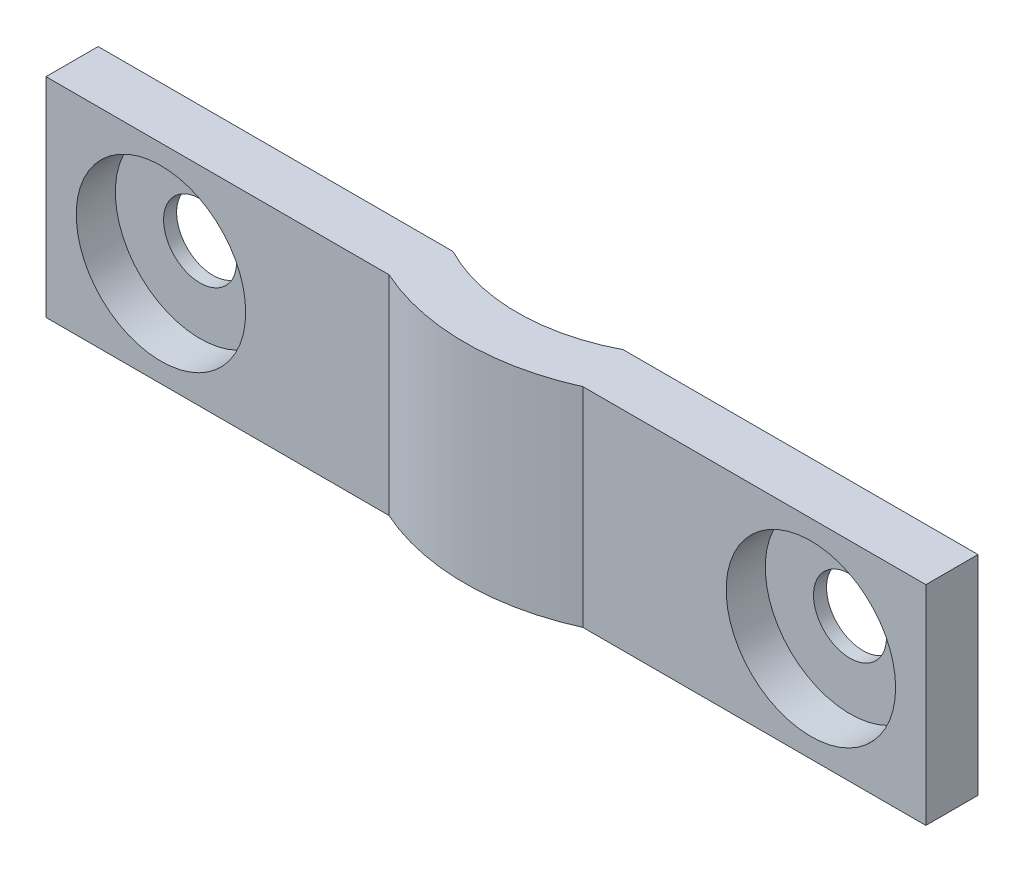
ISO-10303-21;
HEADER;
FILE_DESCRIPTION(('STEP AP214'),'2;1');
FILE_NAME('part.step','',(''),(''),'','','');
FILE_SCHEMA(('AUTOMOTIVE_DESIGN { 1 0 10303 214 1 1 1 1 }'));
ENDSEC;
DATA;
#1=APPLICATION_CONTEXT('core data for automotive mechanical design processes');
#2=APPLICATION_PROTOCOL_DEFINITION('international standard','automotive_design',2000,#1);
#3=PRODUCT_CONTEXT('',#1,'mechanical');
#4=PRODUCT('Part','Part','',(#3));
#5=PRODUCT_RELATED_PRODUCT_CATEGORY('part','',(#4));
#6=PRODUCT_DEFINITION_FORMATION('','',#4);
#7=PRODUCT_DEFINITION_CONTEXT('part definition',#1,'design');
#8=PRODUCT_DEFINITION('design','',#6,#7);
#9=PRODUCT_DEFINITION_SHAPE('','',#8);
#10=(LENGTH_UNIT() NAMED_UNIT(*) SI_UNIT(.MILLI.,.METRE.));
#11=(NAMED_UNIT(*) PLANE_ANGLE_UNIT() SI_UNIT($,.RADIAN.));
#12=(NAMED_UNIT(*) SI_UNIT($,.STERADIAN.) SOLID_ANGLE_UNIT());
#13=UNCERTAINTY_MEASURE_WITH_UNIT(LENGTH_MEASURE(1.E-05),#10,'distance_accuracy_value','');
#14=(GEOMETRIC_REPRESENTATION_CONTEXT(3) GLOBAL_UNCERTAINTY_ASSIGNED_CONTEXT((#13)) GLOBAL_UNIT_ASSIGNED_CONTEXT((#10,
#11,#12)) REPRESENTATION_CONTEXT('',''));
#15=CARTESIAN_POINT('',(0.,0.,0.));
#16=DIRECTION('',(0.,0.,1.));
#17=DIRECTION('',(1.,0.,0.));
#18=AXIS2_PLACEMENT_3D('',#15,#16,#17);
#19=CARTESIAN_POINT('',(-52.019276555044,49.9944163464973,-6.24999999999998));
#20=DIRECTION('',(0.,-1.,0.));
#21=DIRECTION('',(0.,0.,-1.));
#22=AXIS2_PLACEMENT_3D('',#19,#20,#21);
#23=CYLINDRICAL_SURFACE('',#22,9.05);
#24=CARTESIAN_POINT('',(-52.019276555044,41.9944163464973,-6.24999999999998));
#25=DIRECTION('',(0.,1.,0.));
#26=DIRECTION('',(0.,0.,1.));
#27=AXIS2_PLACEMENT_3D('',#24,#25,#26);
#28=CIRCLE('',#27,9.05);
#29=CARTESIAN_POINT('',(-55.7394916025917,41.9944163464973,2.));
#30=VERTEX_POINT('',#29);
#31=CARTESIAN_POINT('',(-48.2990615074963,41.9944163464973,2.));
#32=VERTEX_POINT('',#31);
#33=EDGE_CURVE('E54',#30,#32,#28,.T.);
#34=ORIENTED_EDGE('',*,*,#33,.T.);
#35=DIRECTION('',(0.,-1.,0.));
#36=VECTOR('',#35,1.);
#37=CARTESIAN_POINT('',(-48.2990615074963,49.9944163464973,2.));
#38=LINE('',#37,#36);
#39=CARTESIAN_POINT('',(-48.2990615074963,49.9944163464973,2.));
#40=VERTEX_POINT('',#39);
#41=EDGE_CURVE('E49',#40,#32,#38,.T.);
#42=ORIENTED_EDGE('',*,*,#41,.F.);
#43=CARTESIAN_POINT('',(-52.019276555044,49.9944163464973,-6.24999999999998));
#44=DIRECTION('',(0.,1.,0.));
#45=DIRECTION('',(0.,0.,1.));
#46=AXIS2_PLACEMENT_3D('',#43,#44,#45);
#47=CIRCLE('',#46,9.05);
#48=CARTESIAN_POINT('',(-55.7394916025917,49.9944163464973,2.));
#49=VERTEX_POINT('',#48);
#50=EDGE_CURVE('E153',#49,#40,#47,.T.);
#51=ORIENTED_EDGE('',*,*,#50,.F.);
#52=DIRECTION('',(0.,-1.,0.));
#53=VECTOR('',#52,1.);
#54=CARTESIAN_POINT('',(-55.7394916025917,49.9944163464973,2.));
#55=LINE('',#54,#53);
#56=EDGE_CURVE('E136',#49,#30,#55,.T.);
#57=ORIENTED_EDGE('',*,*,#56,.T.);
#58=EDGE_LOOP('',(#34,#42,#51,#57));
#59=FACE_BOUND('',#58,.T.);
#60=ADVANCED_FACE('F35',(#59),#23,.T.);
#61=CARTESIAN_POINT('',(0.,49.9944163464973,0.));
#62=DIRECTION('',(0.,0.,1.));
#63=DIRECTION('',(1.,0.,0.));
#64=AXIS2_PLACEMENT_3D('',#61,#62,#63);
#65=PLANE('',#64);
#66=CARTESIAN_POINT('',(-64.484276555044,45.9944163464973,0.));
#67=DIRECTION('',(0.,0.,1.));
#68=DIRECTION('',(1.,0.,0.));
#69=AXIS2_PLACEMENT_3D('',#66,#67,#68);
#70=CIRCLE('',#69,1.4);
#71=CARTESIAN_POINT('',(-63.084276555044,45.9944163464973,0.));
#72=VERTEX_POINT('',#71);
#73=EDGE_CURVE('E316',#72,#72,#70,.T.);
#74=ORIENTED_EDGE('',*,*,#73,.T.);
#75=EDGE_LOOP('',(#74));
#76=FACE_BOUND('',#75,.T.);
#77=DIRECTION('',(-1.,0.,0.));
#78=VECTOR('',#77,1.);
#79=CARTESIAN_POINT('',(0.,41.9944163464973,0.));
#80=LINE('',#79,#78);
#81=CARTESIAN_POINT('',(-55.2811778411041,41.9944163464973,0.));
#82=VERTEX_POINT('',#81);
#83=CARTESIAN_POINT('',(-68.894276555044,41.9944163464973,0.));
#84=VERTEX_POINT('',#83);
#85=EDGE_CURVE('E110',#82,#84,#80,.T.);
#86=ORIENTED_EDGE('',*,*,#85,.T.);
#87=DIRECTION('',(0.,1.,0.));
#88=VECTOR('',#87,1.);
#89=CARTESIAN_POINT('',(-68.894276555044,49.9944163464973,0.));
#90=LINE('',#89,#88);
#91=CARTESIAN_POINT('',(-68.894276555044,49.9944163464973,0.));
#92=VERTEX_POINT('',#91);
#93=EDGE_CURVE('E145',#84,#92,#90,.T.);
#94=ORIENTED_EDGE('',*,*,#93,.T.);
#95=DIRECTION('',(-1.,0.,0.));
#96=VECTOR('',#95,1.);
#97=CARTESIAN_POINT('',(0.,49.9944163464973,0.));
#98=LINE('',#97,#96);
#99=CARTESIAN_POINT('',(-55.2811778411041,49.9944163464973,0.));
#100=VERTEX_POINT('',#99);
#101=EDGE_CURVE('E151',#100,#92,#98,.T.);
#102=ORIENTED_EDGE('',*,*,#101,.F.);
#103=DIRECTION('',(0.,-1.,0.));
#104=VECTOR('',#103,1.);
#105=CARTESIAN_POINT('',(-55.2811778411041,49.9944163464973,0.));
#106=LINE('',#105,#104);
#107=EDGE_CURVE('E42',#100,#82,#106,.T.);
#108=ORIENTED_EDGE('',*,*,#107,.T.);
#109=EDGE_LOOP('',(#86,#94,#102,#108));
#110=FACE_BOUND('',#109,.T.);
#111=ADVANCED_FACE('F161',(#76,#110),#65,.F.);
#112=CARTESIAN_POINT('',(-39.554276555044,45.9944163464973,0.));
#113=DIRECTION('',(0.,0.,1.));
#114=DIRECTION('',(1.,0.,0.));
#115=AXIS2_PLACEMENT_3D('',#112,#113,#114);
#116=CIRCLE('',#115,1.4);
#117=CARTESIAN_POINT('',(-38.154276555044,45.9944163464973,0.));
#118=VERTEX_POINT('',#117);
#119=EDGE_CURVE('E322',#118,#118,#116,.F.);
#120=ORIENTED_EDGE('',*,*,#119,.F.);
#121=EDGE_LOOP('',(#120));
#122=FACE_BOUND('',#121,.T.);
#123=CARTESIAN_POINT('',(-35.144276555044,41.9944163464973,0.));
#124=VERTEX_POINT('',#123);
#125=CARTESIAN_POINT('',(-48.757375268984,41.9944163464973,0.));
#126=VERTEX_POINT('',#125);
#127=EDGE_CURVE('E98',#124,#126,#80,.T.);
#128=ORIENTED_EDGE('',*,*,#127,.T.);
#129=DIRECTION('',(0.,-1.,0.));
#130=VECTOR('',#129,1.);
#131=CARTESIAN_POINT('',(-48.757375268984,49.9944163464973,0.));
#132=LINE('',#131,#130);
#133=CARTESIAN_POINT('',(-48.757375268984,49.9944163464973,0.));
#134=VERTEX_POINT('',#133);
#135=EDGE_CURVE('E11',#134,#126,#132,.T.);
#136=ORIENTED_EDGE('',*,*,#135,.F.);
#137=CARTESIAN_POINT('',(-35.144276555044,49.9944163464973,0.));
#138=VERTEX_POINT('',#137);
#139=EDGE_CURVE('E114',#138,#134,#98,.T.);
#140=ORIENTED_EDGE('',*,*,#139,.F.);
#141=DIRECTION('',(0.,1.,0.));
#142=VECTOR('',#141,1.);
#143=CARTESIAN_POINT('',(-35.144276555044,49.9944163464973,0.));
#144=LINE('',#143,#142);
#145=EDGE_CURVE('E112',#124,#138,#144,.T.);
#146=ORIENTED_EDGE('',*,*,#145,.F.);
#147=EDGE_LOOP('',(#128,#136,#140,#146));
#148=FACE_BOUND('',#147,.T.);
#149=ADVANCED_FACE('F113',(#122,#148),#65,.F.);
#150=CARTESIAN_POINT('',(-52.019276555044,49.9944163464973,-6.24999999999998));
#151=DIRECTION('',(0.,-1.,0.));
#152=DIRECTION('',(0.,0.,-1.));
#153=AXIS2_PLACEMENT_3D('',#150,#151,#152);
#154=CYLINDRICAL_SURFACE('',#153,7.05);
#155=CARTESIAN_POINT('',(-52.019276555044,41.9944163464973,-6.24999999999998));
#156=DIRECTION('',(0.,1.,0.));
#157=DIRECTION('',(0.,0.,1.));
#158=AXIS2_PLACEMENT_3D('',#155,#156,#157);
#159=CIRCLE('',#158,7.05);
#160=EDGE_CURVE('E106',#82,#126,#159,.T.);
#161=ORIENTED_EDGE('',*,*,#160,.F.);
#162=ORIENTED_EDGE('',*,*,#107,.F.);
#163=CARTESIAN_POINT('',(-52.019276555044,49.9944163464973,-6.24999999999998));
#164=DIRECTION('',(0.,1.,0.));
#165=DIRECTION('',(0.,0.,1.));
#166=AXIS2_PLACEMENT_3D('',#163,#164,#165);
#167=CIRCLE('',#166,7.05);
#168=EDGE_CURVE('E155',#100,#134,#167,.T.);
#169=ORIENTED_EDGE('',*,*,#168,.T.);
#170=ORIENTED_EDGE('',*,*,#135,.T.);
#171=EDGE_LOOP('',(#161,#162,#169,#170));
#172=FACE_BOUND('',#171,.T.);
#173=ADVANCED_FACE('F166',(#172),#154,.F.);
#174=CARTESIAN_POINT('',(0.,49.9944163464973,0.));
#175=DIRECTION('',(0.,1.,0.));
#176=DIRECTION('',(0.,0.,1.));
#177=AXIS2_PLACEMENT_3D('',#174,#175,#176);
#178=PLANE('',#177);
#179=ORIENTED_EDGE('',*,*,#101,.T.);
#180=DIRECTION('',(0.,0.,1.));
#181=VECTOR('',#180,1.);
#182=CARTESIAN_POINT('',(-68.894276555044,49.9944163464973,0.));
#183=LINE('',#182,#181);
#184=CARTESIAN_POINT('',(-68.894276555044,49.9944163464973,2.));
#185=VERTEX_POINT('',#184);
#186=EDGE_CURVE('E142',#92,#185,#183,.T.);
#187=ORIENTED_EDGE('',*,*,#186,.T.);
#188=DIRECTION('',(-1.,0.,0.));
#189=VECTOR('',#188,1.);
#190=CARTESIAN_POINT('',(-45.4730492862626,49.9944163464973,2.));
#191=LINE('',#190,#189);
#192=EDGE_CURVE('E141',#49,#185,#191,.T.);
#193=ORIENTED_EDGE('',*,*,#192,.F.);
#194=ORIENTED_EDGE('',*,*,#50,.T.);
#195=DIRECTION('',(1.,0.,0.));
#196=VECTOR('',#195,1.);
#197=CARTESIAN_POINT('',(-68.895276555044,49.9944163464973,2.));
#198=LINE('',#197,#196);
#199=CARTESIAN_POINT('',(-35.144276555044,49.9944163464973,2.));
#200=VERTEX_POINT('',#199);
#201=EDGE_CURVE('E129',#40,#200,#198,.T.);
#202=ORIENTED_EDGE('',*,*,#201,.T.);
#203=DIRECTION('',(0.,0.,1.));
#204=VECTOR('',#203,1.);
#205=CARTESIAN_POINT('',(-35.144276555044,49.9944163464973,0.));
#206=LINE('',#205,#204);
#207=EDGE_CURVE('E124',#138,#200,#206,.T.);
#208=ORIENTED_EDGE('',*,*,#207,.F.);
#209=ORIENTED_EDGE('',*,*,#139,.T.);
#210=ORIENTED_EDGE('',*,*,#168,.F.);
#211=EDGE_LOOP('',(#179,#187,#193,#194,#202,#208,#209,#210));
#212=FACE_BOUND('',#211,.T.);
#213=ADVANCED_FACE('F168',(#212),#178,.T.);
#214=CARTESIAN_POINT('',(0.,41.9944163464973,0.));
#215=DIRECTION('',(0.,1.,0.));
#216=DIRECTION('',(0.,0.,1.));
#217=AXIS2_PLACEMENT_3D('',#214,#215,#216);
#218=PLANE('',#217);
#219=ORIENTED_EDGE('',*,*,#85,.F.);
#220=ORIENTED_EDGE('',*,*,#160,.T.);
#221=ORIENTED_EDGE('',*,*,#127,.F.);
#222=DIRECTION('',(0.,0.,-1.));
#223=VECTOR('',#222,1.);
#224=CARTESIAN_POINT('',(-35.144276555044,41.9944163464973,0.));
#225=LINE('',#224,#223);
#226=CARTESIAN_POINT('',(-35.144276555044,41.9944163464973,2.));
#227=VERTEX_POINT('',#226);
#228=EDGE_CURVE('E103',#227,#124,#225,.T.);
#229=ORIENTED_EDGE('',*,*,#228,.F.);
#230=DIRECTION('',(1.,0.,0.));
#231=VECTOR('',#230,1.);
#232=CARTESIAN_POINT('',(-68.895276555044,41.9944163464973,2.));
#233=LINE('',#232,#231);
#234=EDGE_CURVE('E131',#32,#227,#233,.T.);
#235=ORIENTED_EDGE('',*,*,#234,.F.);
#236=ORIENTED_EDGE('',*,*,#33,.F.);
#237=DIRECTION('',(-1.,0.,0.));
#238=VECTOR('',#237,1.);
#239=CARTESIAN_POINT('',(-45.4730492862626,41.9944163464973,2.));
#240=LINE('',#239,#238);
#241=CARTESIAN_POINT('',(-68.894276555044,41.9944163464973,2.));
#242=VERTEX_POINT('',#241);
#243=EDGE_CURVE('E137',#30,#242,#240,.T.);
#244=ORIENTED_EDGE('',*,*,#243,.T.);
#245=DIRECTION('',(0.,0.,-1.));
#246=VECTOR('',#245,1.);
#247=CARTESIAN_POINT('',(-68.894276555044,41.9944163464973,0.));
#248=LINE('',#247,#246);
#249=EDGE_CURVE('E133',#242,#84,#248,.T.);
#250=ORIENTED_EDGE('',*,*,#249,.T.);
#251=EDGE_LOOP('',(#219,#220,#221,#229,#235,#236,#244,#250));
#252=FACE_BOUND('',#251,.T.);
#253=ADVANCED_FACE('F101',(#252),#218,.F.);
#254=CARTESIAN_POINT('',(-45.4730492862626,49.9944163464973,2.));
#255=DIRECTION('',(0.,0.,-1.));
#256=DIRECTION('',(0.,1.,0.));
#257=AXIS2_PLACEMENT_3D('',#254,#255,#256);
#258=PLANE('',#257);
#259=CARTESIAN_POINT('',(-64.484276555044,45.9944163464973,1.99999999999999));
#260=DIRECTION('',(0.,0.,1.));
#261=DIRECTION('',(1.,0.,0.));
#262=AXIS2_PLACEMENT_3D('',#259,#260,#261);
#263=CIRCLE('',#262,3.25000000000001);
#264=CARTESIAN_POINT('',(-61.234276555044,45.9944163464973,1.99999999999999));
#265=VERTEX_POINT('',#264);
#266=EDGE_CURVE('E319',#265,#265,#263,.F.);
#267=ORIENTED_EDGE('',*,*,#266,.T.);
#268=EDGE_LOOP('',(#267));
#269=FACE_BOUND('',#268,.T.);
#270=ORIENTED_EDGE('',*,*,#56,.F.);
#271=ORIENTED_EDGE('',*,*,#192,.T.);
#272=DIRECTION('',(0.,-1.,0.));
#273=VECTOR('',#272,1.);
#274=CARTESIAN_POINT('',(-68.894276555044,49.9944163464973,2.));
#275=LINE('',#274,#273);
#276=EDGE_CURVE('E138',#185,#242,#275,.T.);
#277=ORIENTED_EDGE('',*,*,#276,.T.);
#278=ORIENTED_EDGE('',*,*,#243,.F.);
#279=EDGE_LOOP('',(#270,#271,#277,#278));
#280=FACE_BOUND('',#279,.T.);
#281=ADVANCED_FACE('F177',(#269,#280),#258,.F.);
#282=CARTESIAN_POINT('',(-68.894276555044,0.,0.));
#283=DIRECTION('',(-1.,0.,0.));
#284=DIRECTION('',(0.,0.,1.));
#285=AXIS2_PLACEMENT_3D('',#282,#283,#284);
#286=PLANE('',#285);
#287=ORIENTED_EDGE('',*,*,#93,.F.);
#288=ORIENTED_EDGE('',*,*,#249,.F.);
#289=ORIENTED_EDGE('',*,*,#276,.F.);
#290=ORIENTED_EDGE('',*,*,#186,.F.);
#291=EDGE_LOOP('',(#287,#288,#289,#290));
#292=FACE_BOUND('',#291,.T.);
#293=ADVANCED_FACE('F180',(#292),#286,.T.);
#294=CARTESIAN_POINT('',(-35.144276555044,0.,0.));
#295=DIRECTION('',(1.,0.,0.));
#296=DIRECTION('',(0.,0.,1.));
#297=AXIS2_PLACEMENT_3D('',#294,#295,#296);
#298=PLANE('',#297);
#299=ORIENTED_EDGE('',*,*,#145,.T.);
#300=ORIENTED_EDGE('',*,*,#207,.T.);
#301=DIRECTION('',(0.,-1.,0.));
#302=VECTOR('',#301,1.);
#303=CARTESIAN_POINT('',(-35.144276555044,49.9944163464973,2.));
#304=LINE('',#303,#302);
#305=EDGE_CURVE('E122',#200,#227,#304,.T.);
#306=ORIENTED_EDGE('',*,*,#305,.T.);
#307=ORIENTED_EDGE('',*,*,#228,.T.);
#308=EDGE_LOOP('',(#299,#300,#306,#307));
#309=FACE_BOUND('',#308,.T.);
#310=ADVANCED_FACE('F120',(#309),#298,.T.);
#311=CARTESIAN_POINT('',(-68.895276555044,49.9944163464973,2.));
#312=DIRECTION('',(0.,0.,1.));
#313=DIRECTION('',(0.,-1.,0.));
#314=AXIS2_PLACEMENT_3D('',#311,#312,#313);
#315=PLANE('',#314);
#316=CARTESIAN_POINT('',(-39.554276555044,45.9944163464973,1.99999999999999));
#317=DIRECTION('',(0.,0.,1.));
#318=DIRECTION('',(1.,0.,0.));
#319=AXIS2_PLACEMENT_3D('',#316,#317,#318);
#320=CIRCLE('',#319,3.25);
#321=CARTESIAN_POINT('',(-36.304276555044,45.9944163464973,1.99999999999999));
#322=VERTEX_POINT('',#321);
#323=EDGE_CURVE('E329',#322,#322,#320,.T.);
#324=ORIENTED_EDGE('',*,*,#323,.F.);
#325=EDGE_LOOP('',(#324));
#326=FACE_BOUND('',#325,.T.);
#327=ORIENTED_EDGE('',*,*,#201,.F.);
#328=ORIENTED_EDGE('',*,*,#41,.T.);
#329=ORIENTED_EDGE('',*,*,#234,.T.);
#330=ORIENTED_EDGE('',*,*,#305,.F.);
#331=EDGE_LOOP('',(#327,#328,#329,#330));
#332=FACE_BOUND('',#331,.T.);
#333=ADVANCED_FACE('F173',(#326,#332),#315,.T.);
#334=CARTESIAN_POINT('',(-39.554276555044,45.9944163464973,0.499999999999995));
#335=DIRECTION('',(0.,0.,1.));
#336=DIRECTION('',(1.,0.,0.));
#337=AXIS2_PLACEMENT_3D('',#334,#335,#336);
#338=CYLINDRICAL_SURFACE('',#337,3.25);
#339=CARTESIAN_POINT('',(-39.554276555044,45.9944163464973,0.499999999999995));
#340=DIRECTION('',(0.,0.,1.));
#341=DIRECTION('',(1.,0.,0.));
#342=AXIS2_PLACEMENT_3D('',#339,#340,#341);
#343=CIRCLE('',#342,3.25);
#344=CARTESIAN_POINT('',(-36.304276555044,45.9944163464973,0.499999999999995));
#345=VERTEX_POINT('',#344);
#346=EDGE_CURVE('E118',#345,#345,#343,.T.);
#347=ORIENTED_EDGE('',*,*,#346,.F.);
#348=EDGE_LOOP('',(#347));
#349=FACE_BOUND('',#348,.T.);
#350=ORIENTED_EDGE('',*,*,#323,.T.);
#351=EDGE_LOOP('',(#350));
#352=FACE_BOUND('',#351,.T.);
#353=ADVANCED_FACE('F233',(#349,#352),#338,.F.);
#354=CARTESIAN_POINT('',(0.,0.,0.499999999999995));
#355=DIRECTION('',(0.,0.,1.));
#356=DIRECTION('',(1.,0.,0.));
#357=AXIS2_PLACEMENT_3D('',#354,#355,#356);
#358=PLANE('',#357);
#359=CARTESIAN_POINT('',(-39.554276555044,45.9944163464973,0.499999999999995));
#360=DIRECTION('',(0.,0.,1.));
#361=DIRECTION('',(1.,0.,0.));
#362=AXIS2_PLACEMENT_3D('',#359,#360,#361);
#363=CIRCLE('',#362,1.4);
#364=CARTESIAN_POINT('',(-38.154276555044,45.9944163464973,0.499999999999995));
#365=VERTEX_POINT('',#364);
#366=EDGE_CURVE('E317',#365,#365,#363,.T.);
#367=ORIENTED_EDGE('',*,*,#366,.F.);
#368=EDGE_LOOP('',(#367));
#369=FACE_BOUND('',#368,.T.);
#370=ORIENTED_EDGE('',*,*,#346,.T.);
#371=EDGE_LOOP('',(#370));
#372=FACE_BOUND('',#371,.T.);
#373=ADVANCED_FACE('F242',(#369,#372),#358,.T.);
#374=CARTESIAN_POINT('',(-64.484276555044,45.9944163464973,0.499999999999995));
#375=DIRECTION('',(0.,0.,1.));
#376=DIRECTION('',(1.,0.,0.));
#377=AXIS2_PLACEMENT_3D('',#374,#375,#376);
#378=CYLINDRICAL_SURFACE('',#377,3.25000000000001);
#379=CARTESIAN_POINT('',(-64.484276555044,45.9944163464973,0.499999999999995));
#380=DIRECTION('',(0.,0.,1.));
#381=DIRECTION('',(1.,0.,0.));
#382=AXIS2_PLACEMENT_3D('',#379,#380,#381);
#383=CIRCLE('',#382,3.25000000000001);
#384=CARTESIAN_POINT('',(-61.234276555044,45.9944163464973,0.499999999999995));
#385=VERTEX_POINT('',#384);
#386=EDGE_CURVE('E332',#385,#385,#383,.F.);
#387=ORIENTED_EDGE('',*,*,#386,.T.);
#388=EDGE_LOOP('',(#387));
#389=FACE_BOUND('',#388,.T.);
#390=ORIENTED_EDGE('',*,*,#266,.F.);
#391=EDGE_LOOP('',(#390));
#392=FACE_BOUND('',#391,.T.);
#393=ADVANCED_FACE('F250',(#389,#392),#378,.F.);
#394=CARTESIAN_POINT('',(0.,0.,0.499999999999995));
#395=DIRECTION('',(0.,0.,1.));
#396=DIRECTION('',(1.,0.,0.));
#397=AXIS2_PLACEMENT_3D('',#394,#395,#396);
#398=PLANE('',#397);
#399=CARTESIAN_POINT('',(-64.484276555044,45.9944163464973,0.499999999999995));
#400=DIRECTION('',(0.,0.,1.));
#401=DIRECTION('',(1.,0.,0.));
#402=AXIS2_PLACEMENT_3D('',#399,#400,#401);
#403=CIRCLE('',#402,1.4);
#404=CARTESIAN_POINT('',(-63.084276555044,45.9944163464973,0.499999999999995));
#405=VERTEX_POINT('',#404);
#406=EDGE_CURVE('E314',#405,#405,#403,.F.);
#407=ORIENTED_EDGE('',*,*,#406,.T.);
#408=EDGE_LOOP('',(#407));
#409=FACE_BOUND('',#408,.T.);
#410=ORIENTED_EDGE('',*,*,#386,.F.);
#411=EDGE_LOOP('',(#410));
#412=FACE_BOUND('',#411,.T.);
#413=ADVANCED_FACE('F254',(#409,#412),#398,.T.);
#414=CARTESIAN_POINT('',(-39.554276555044,45.9944163464973,-0.001000000000001));
#415=DIRECTION('',(0.,0.,1.));
#416=DIRECTION('',(1.,0.,0.));
#417=AXIS2_PLACEMENT_3D('',#414,#415,#416);
#418=CYLINDRICAL_SURFACE('',#417,1.4);
#419=ORIENTED_EDGE('',*,*,#366,.T.);
#420=EDGE_LOOP('',(#419));
#421=FACE_BOUND('',#420,.T.);
#422=ORIENTED_EDGE('',*,*,#119,.T.);
#423=EDGE_LOOP('',(#422));
#424=FACE_BOUND('',#423,.T.);
#425=ADVANCED_FACE('F287',(#421,#424),#418,.F.);
#426=CARTESIAN_POINT('',(-64.484276555044,45.9944163464973,-0.001000000000001));
#427=DIRECTION('',(0.,0.,1.));
#428=DIRECTION('',(1.,0.,0.));
#429=AXIS2_PLACEMENT_3D('',#426,#427,#428);
#430=CYLINDRICAL_SURFACE('',#429,1.4);
#431=ORIENTED_EDGE('',*,*,#406,.F.);
#432=EDGE_LOOP('',(#431));
#433=FACE_BOUND('',#432,.T.);
#434=ORIENTED_EDGE('',*,*,#73,.F.);
#435=EDGE_LOOP('',(#434));
#436=FACE_BOUND('',#435,.T.);
#437=ADVANCED_FACE('F297',(#433,#436),#430,.F.);
#438=CLOSED_SHELL('',(#60,#111,#149,#173,#213,#253,#281,#293,#310,#333,#353,#373,#393,#413,#425,#437));
#439=MANIFOLD_SOLID_BREP('B2',#438);
#440=ADVANCED_BREP_SHAPE_REPRESENTATION('',(#18,#439),#14);
#441=SHAPE_DEFINITION_REPRESENTATION(#9,#440);
ENDSEC;
END-ISO-10303-21;
